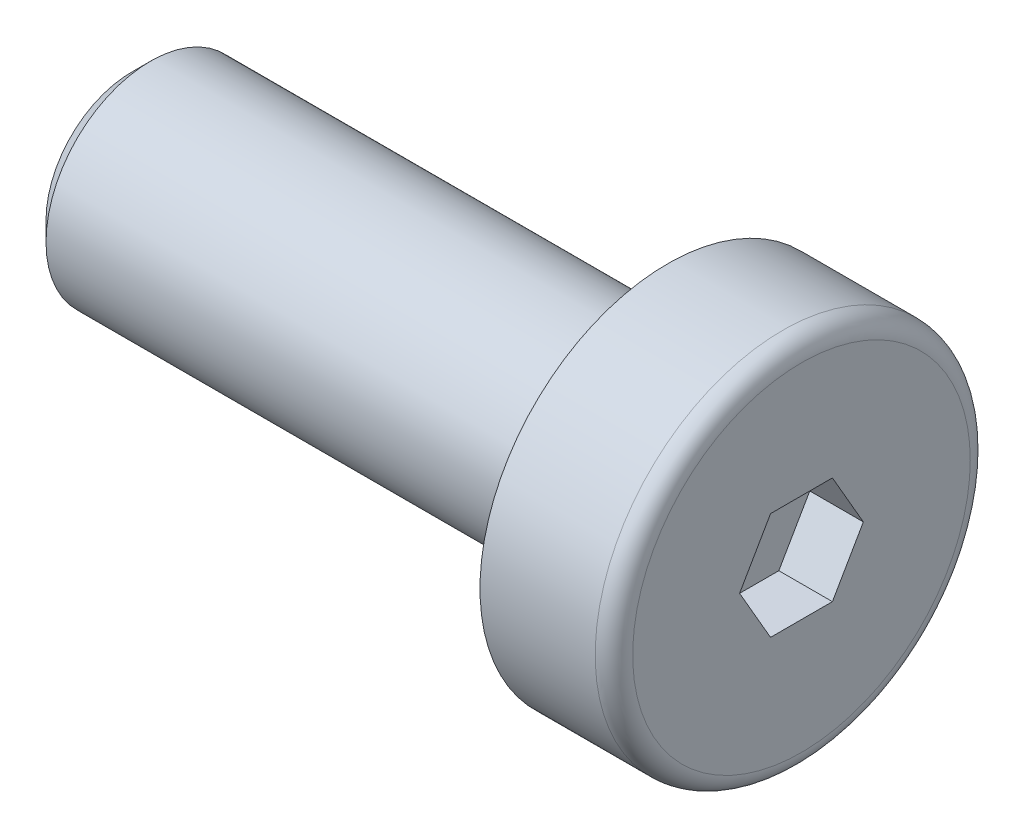
ISO-10303-21;
HEADER;
FILE_DESCRIPTION(('STEP AP214'),'2;1');
FILE_NAME('part.step','',(''),(''),'','','');
FILE_SCHEMA(('AUTOMOTIVE_DESIGN { 1 0 10303 214 1 1 1 1 }'));
ENDSEC;
DATA;
#1=APPLICATION_CONTEXT('core data for automotive mechanical design processes');
#2=APPLICATION_PROTOCOL_DEFINITION('international standard','automotive_design',2000,#1);
#3=PRODUCT_CONTEXT('',#1,'mechanical');
#4=PRODUCT('Part','Part','',(#3));
#5=PRODUCT_RELATED_PRODUCT_CATEGORY('part','',(#4));
#6=PRODUCT_DEFINITION_FORMATION('','',#4);
#7=PRODUCT_DEFINITION_CONTEXT('part definition',#1,'design');
#8=PRODUCT_DEFINITION('design','',#6,#7);
#9=PRODUCT_DEFINITION_SHAPE('','',#8);
#10=(LENGTH_UNIT() NAMED_UNIT(*) SI_UNIT(.MILLI.,.METRE.));
#11=(NAMED_UNIT(*) PLANE_ANGLE_UNIT() SI_UNIT($,.RADIAN.));
#12=(NAMED_UNIT(*) SI_UNIT($,.STERADIAN.) SOLID_ANGLE_UNIT());
#13=UNCERTAINTY_MEASURE_WITH_UNIT(LENGTH_MEASURE(1.E-05),#10,'distance_accuracy_value','');
#14=(GEOMETRIC_REPRESENTATION_CONTEXT(3) GLOBAL_UNCERTAINTY_ASSIGNED_CONTEXT((#13)) GLOBAL_UNIT_ASSIGNED_CONTEXT((#10,
#11,#12)) REPRESENTATION_CONTEXT('',''));
#15=CARTESIAN_POINT('',(0.,0.,0.));
#16=DIRECTION('',(0.,0.,1.));
#17=DIRECTION('',(1.,0.,0.));
#18=AXIS2_PLACEMENT_3D('',#15,#16,#17);
#19=CARTESIAN_POINT('',(0.,0.,0.));
#20=DIRECTION('',(-1.,0.,0.));
#21=DIRECTION('',(0.,0.,-1.));
#22=AXIS2_PLACEMENT_3D('',#19,#20,#21);
#23=PLANE('',#22);
#24=DIRECTION('',(0.,0.866025403784438,-0.5));
#25=VECTOR('',#24,1.);
#26=CARTESIAN_POINT('',(0.,0.,1.15470053837925));
#27=LINE('',#26,#25);
#28=CARTESIAN_POINT('',(0.,0.,1.15470053837925));
#29=VERTEX_POINT('',#28);
#30=CARTESIAN_POINT('',(0.,1.,0.577350269189625));
#31=VERTEX_POINT('',#30);
#32=EDGE_CURVE('E106',#29,#31,#27,.T.);
#33=ORIENTED_EDGE('',*,*,#32,.T.);
#34=DIRECTION('',(0.,0.,-1.));
#35=VECTOR('',#34,1.);
#36=CARTESIAN_POINT('',(0.,1.,0.577350269189625));
#37=LINE('',#36,#35);
#38=CARTESIAN_POINT('',(0.,1.,-0.577350269189626));
#39=VERTEX_POINT('',#38);
#40=EDGE_CURVE('E110',#31,#39,#37,.T.);
#41=ORIENTED_EDGE('',*,*,#40,.T.);
#42=DIRECTION('',(0.,-0.866025403784438,-0.5));
#43=VECTOR('',#42,1.);
#44=CARTESIAN_POINT('',(0.,1.,-0.577350269189626));
#45=LINE('',#44,#43);
#46=CARTESIAN_POINT('',(0.,0.,-1.15470053837925));
#47=VERTEX_POINT('',#46);
#48=EDGE_CURVE('E115',#39,#47,#45,.T.);
#49=ORIENTED_EDGE('',*,*,#48,.T.);
#50=DIRECTION('',(0.,-0.866025403784439,0.5));
#51=VECTOR('',#50,1.);
#52=CARTESIAN_POINT('',(0.,0.,-1.15470053837925));
#53=LINE('',#52,#51);
#54=CARTESIAN_POINT('',(0.,-1.,-0.577350269189626));
#55=VERTEX_POINT('',#54);
#56=EDGE_CURVE('E125',#47,#55,#53,.T.);
#57=ORIENTED_EDGE('',*,*,#56,.T.);
#58=DIRECTION('',(0.,0.,1.));
#59=VECTOR('',#58,1.);
#60=CARTESIAN_POINT('',(0.,-1.,-0.577350269189626));
#61=LINE('',#60,#59);
#62=CARTESIAN_POINT('',(0.,-0.999999999999999,0.577350269189627));
#63=VERTEX_POINT('',#62);
#64=EDGE_CURVE('E128',#55,#63,#61,.T.);
#65=ORIENTED_EDGE('',*,*,#64,.T.);
#66=DIRECTION('',(0.,0.866025403784439,0.5));
#67=VECTOR('',#66,1.);
#68=CARTESIAN_POINT('',(0.,-0.999999999999999,0.577350269189627));
#69=LINE('',#68,#67);
#70=EDGE_CURVE('E119',#63,#29,#69,.T.);
#71=ORIENTED_EDGE('',*,*,#70,.T.);
#72=EDGE_LOOP('',(#33,#41,#49,#57,#65,#71));
#73=FACE_BOUND('',#72,.T.);
#74=CARTESIAN_POINT('',(0.,0.,0.));
#75=DIRECTION('',(1.,0.,0.));
#76=DIRECTION('',(0.,0.,-1.));
#77=AXIS2_PLACEMENT_3D('',#74,#75,#76);
#78=CIRCLE('',#77,3.15);
#79=CARTESIAN_POINT('',(0.,0.,-3.15));
#80=VERTEX_POINT('',#79);
#81=EDGE_CURVE('E12',#80,#80,#78,.F.);
#82=ORIENTED_EDGE('',*,*,#81,.F.);
#83=EDGE_LOOP('',(#82));
#84=FACE_BOUND('',#83,.T.);
#85=ADVANCED_FACE('F39',(#73,#84),#23,.F.);
#86=CARTESIAN_POINT('',(-123.158940217391,0.,0.));
#87=DIRECTION('',(-1.,0.,0.));
#88=DIRECTION('',(0.,0.,-1.));
#89=AXIS2_PLACEMENT_3D('',#86,#87,#88);
#90=CYLINDRICAL_SURFACE('',#89,3.5);
#91=CARTESIAN_POINT('',(-0.350000000000003,0.,0.));
#92=DIRECTION('',(1.,0.,0.));
#93=DIRECTION('',(0.,0.,-1.));
#94=AXIS2_PLACEMENT_3D('',#91,#92,#93);
#95=CIRCLE('',#94,3.5);
#96=CARTESIAN_POINT('',(-0.350000000000003,0.,-3.5));
#97=VERTEX_POINT('',#96);
#98=EDGE_CURVE('E47',#97,#97,#95,.T.);
#99=ORIENTED_EDGE('',*,*,#98,.F.);
#100=EDGE_LOOP('',(#99));
#101=FACE_BOUND('',#100,.T.);
#102=CARTESIAN_POINT('',(-2.5,0.,0.));
#103=DIRECTION('',(1.,0.,0.));
#104=DIRECTION('',(0.,0.,-1.));
#105=AXIS2_PLACEMENT_3D('',#102,#103,#104);
#106=CIRCLE('',#105,3.5);
#107=CARTESIAN_POINT('',(-2.5,0.,-3.5));
#108=VERTEX_POINT('',#107);
#109=EDGE_CURVE('E143',#108,#108,#106,.T.);
#110=ORIENTED_EDGE('',*,*,#109,.T.);
#111=EDGE_LOOP('',(#110));
#112=FACE_BOUND('',#111,.T.);
#113=ADVANCED_FACE('F155',(#101,#112),#90,.T.);
#114=CARTESIAN_POINT('',(-2.5,3.5,0.));
#115=DIRECTION('',(1.,0.,0.));
#116=DIRECTION('',(0.,0.,1.));
#117=AXIS2_PLACEMENT_3D('',#114,#115,#116);
#118=PLANE('',#117);
#119=ORIENTED_EDGE('',*,*,#109,.F.);
#120=EDGE_LOOP('',(#119));
#121=FACE_BOUND('',#120,.T.);
#122=CARTESIAN_POINT('',(-2.5,0.,0.));
#123=DIRECTION('',(-1.,0.,0.));
#124=DIRECTION('',(0.,0.,1.));
#125=AXIS2_PLACEMENT_3D('',#122,#123,#124);
#126=CIRCLE('',#125,1.95);
#127=CARTESIAN_POINT('',(-2.5,0.,1.95));
#128=VERTEX_POINT('',#127);
#129=EDGE_CURVE('E139',#128,#128,#126,.T.);
#130=ORIENTED_EDGE('',*,*,#129,.F.);
#131=EDGE_LOOP('',(#130));
#132=FACE_BOUND('',#131,.T.);
#133=ADVANCED_FACE('F158',(#121,#132),#118,.F.);
#134=CARTESIAN_POINT('',(0.,0.,0.));
#135=DIRECTION('',(1.,0.,0.));
#136=DIRECTION('',(0.,0.,1.));
#137=AXIS2_PLACEMENT_3D('',#134,#135,#136);
#138=CYLINDRICAL_SURFACE('',#137,1.95);
#139=CARTESIAN_POINT('',(-12.15,0.,0.));
#140=DIRECTION('',(-1.,0.,0.));
#141=DIRECTION('',(0.,0.,1.));
#142=AXIS2_PLACEMENT_3D('',#139,#140,#141);
#143=CIRCLE('',#142,1.95);
#144=CARTESIAN_POINT('',(-12.15,0.,1.95));
#145=VERTEX_POINT('',#144);
#146=EDGE_CURVE('E146',#145,#145,#143,.T.);
#147=ORIENTED_EDGE('',*,*,#146,.F.);
#148=EDGE_LOOP('',(#147));
#149=FACE_BOUND('',#148,.T.);
#150=ORIENTED_EDGE('',*,*,#129,.T.);
#151=EDGE_LOOP('',(#150));
#152=FACE_BOUND('',#151,.T.);
#153=ADVANCED_FACE('F164',(#149,#152),#138,.T.);
#154=CARTESIAN_POINT('',(-12.5,2.,0.));
#155=DIRECTION('',(1.,0.,0.));
#156=DIRECTION('',(0.,0.,1.));
#157=AXIS2_PLACEMENT_3D('',#154,#155,#156);
#158=PLANE('',#157);
#159=CARTESIAN_POINT('',(-12.5,0.,0.));
#160=DIRECTION('',(-1.,0.,0.));
#161=DIRECTION('',(0.,0.,1.));
#162=AXIS2_PLACEMENT_3D('',#159,#160,#161);
#163=CIRCLE('',#162,1.59999999999999);
#164=CARTESIAN_POINT('',(-12.5,0.,1.59999999999999));
#165=VERTEX_POINT('',#164);
#166=EDGE_CURVE('E149',#165,#165,#163,.F.);
#167=ORIENTED_EDGE('',*,*,#166,.F.);
#168=EDGE_LOOP('',(#167));
#169=FACE_BOUND('',#168,.T.);
#170=ADVANCED_FACE('F169',(#169),#158,.F.);
#171=CARTESIAN_POINT('',(-12.15,0.,0.));
#172=DIRECTION('',(1.,0.,0.));
#173=DIRECTION('',(0.,0.,1.));
#174=AXIS2_PLACEMENT_3D('',#171,#172,#173);
#175=CONICAL_SURFACE('',#174,1.95,0.785398163397451);
#176=ORIENTED_EDGE('',*,*,#166,.T.);
#177=EDGE_LOOP('',(#176));
#178=FACE_BOUND('',#177,.T.);
#179=ORIENTED_EDGE('',*,*,#146,.T.);
#180=EDGE_LOOP('',(#179));
#181=FACE_BOUND('',#180,.T.);
#182=ADVANCED_FACE('F175',(#178,#181),#175,.T.);
#183=CARTESIAN_POINT('',(-0.350000000000003,0.,0.));
#184=DIRECTION('',(-1.,0.,0.));
#185=DIRECTION('',(0.,0.,-1.));
#186=AXIS2_PLACEMENT_3D('',#183,#184,#185);
#187=TOROIDAL_SURFACE('',#186,3.15,0.35);
#188=ORIENTED_EDGE('',*,*,#81,.T.);
#189=EDGE_LOOP('',(#188));
#190=FACE_BOUND('',#189,.T.);
#191=ORIENTED_EDGE('',*,*,#98,.T.);
#192=EDGE_LOOP('',(#191));
#193=FACE_BOUND('',#192,.T.);
#194=ADVANCED_FACE('F41',(#190,#193),#187,.T.);
#195=CARTESIAN_POINT('',(-5.55505046330389,-0.999999999999999,0.577350269189627));
#196=DIRECTION('',(0.,-0.5,0.866025403784438));
#197=DIRECTION('',(0.,0.866025403784439,0.5));
#198=AXIS2_PLACEMENT_3D('',#195,#196,#197);
#199=PLANE('',#198);
#200=DIRECTION('',(0.,-0.866025403784439,-0.5));
#201=VECTOR('',#200,1.);
#202=CARTESIAN_POINT('',(-1.,-0.999999999999999,0.577350269189627));
#203=LINE('',#202,#201);
#204=CARTESIAN_POINT('',(-1.,0.,1.15470053837925));
#205=VERTEX_POINT('',#204);
#206=CARTESIAN_POINT('',(-1.,-0.999999999999999,0.577350269189627));
#207=VERTEX_POINT('',#206);
#208=EDGE_CURVE('E140',#205,#207,#203,.T.);
#209=ORIENTED_EDGE('',*,*,#208,.F.);
#210=DIRECTION('',(1.,0.,0.));
#211=VECTOR('',#210,1.);
#212=CARTESIAN_POINT('',(-5.55505046330389,0.,1.15470053837925));
#213=LINE('',#212,#211);
#214=EDGE_CURVE('E54',#205,#29,#213,.T.);
#215=ORIENTED_EDGE('',*,*,#214,.T.);
#216=ORIENTED_EDGE('',*,*,#70,.F.);
#217=DIRECTION('',(1.,0.,0.));
#218=VECTOR('',#217,1.);
#219=CARTESIAN_POINT('',(-5.55505046330389,-0.999999999999999,0.577350269189627));
#220=LINE('',#219,#218);
#221=EDGE_CURVE('E130',#207,#63,#220,.T.);
#222=ORIENTED_EDGE('',*,*,#221,.F.);
#223=EDGE_LOOP('',(#209,#215,#216,#222));
#224=FACE_BOUND('',#223,.T.);
#225=ADVANCED_FACE('F189',(#224),#199,.F.);
#226=CARTESIAN_POINT('',(-5.55505046330389,-1.,-0.577350269189626));
#227=DIRECTION('',(0.,-1.,0.));
#228=DIRECTION('',(0.,0.,1.));
#229=AXIS2_PLACEMENT_3D('',#226,#227,#228);
#230=PLANE('',#229);
#231=DIRECTION('',(0.,0.,-1.));
#232=VECTOR('',#231,1.);
#233=CARTESIAN_POINT('',(-1.,-1.,-0.577350269189626));
#234=LINE('',#233,#232);
#235=CARTESIAN_POINT('',(-1.,-0.999999999999999,-0.577350269189626));
#236=VERTEX_POINT('',#235);
#237=EDGE_CURVE('E76',#207,#236,#234,.T.);
#238=ORIENTED_EDGE('',*,*,#237,.F.);
#239=ORIENTED_EDGE('',*,*,#221,.T.);
#240=ORIENTED_EDGE('',*,*,#64,.F.);
#241=DIRECTION('',(1.,0.,0.));
#242=VECTOR('',#241,1.);
#243=CARTESIAN_POINT('',(-5.55505046330389,-1.,-0.577350269189626));
#244=LINE('',#243,#242);
#245=EDGE_CURVE('E132',#236,#55,#244,.T.);
#246=ORIENTED_EDGE('',*,*,#245,.F.);
#247=EDGE_LOOP('',(#238,#239,#240,#246));
#248=FACE_BOUND('',#247,.T.);
#249=ADVANCED_FACE('F196',(#248),#230,.F.);
#250=CARTESIAN_POINT('',(-5.55505046330389,0.,-1.15470053837925));
#251=DIRECTION('',(0.,-0.5,-0.866025403784439));
#252=DIRECTION('',(0.,-0.866025403784439,0.5));
#253=AXIS2_PLACEMENT_3D('',#250,#251,#252);
#254=PLANE('',#253);
#255=DIRECTION('',(0.,0.866025403784439,-0.5));
#256=VECTOR('',#255,1.);
#257=CARTESIAN_POINT('',(-1.,0.,-1.15470053837925));
#258=LINE('',#257,#256);
#259=CARTESIAN_POINT('',(-1.,0.,-1.15470053837925));
#260=VERTEX_POINT('',#259);
#261=EDGE_CURVE('E220',#236,#260,#258,.T.);
#262=ORIENTED_EDGE('',*,*,#261,.F.);
#263=ORIENTED_EDGE('',*,*,#245,.T.);
#264=ORIENTED_EDGE('',*,*,#56,.F.);
#265=DIRECTION('',(1.,0.,0.));
#266=VECTOR('',#265,1.);
#267=CARTESIAN_POINT('',(-5.55505046330389,0.,-1.15470053837925));
#268=LINE('',#267,#266);
#269=EDGE_CURVE('E134',#260,#47,#268,.T.);
#270=ORIENTED_EDGE('',*,*,#269,.F.);
#271=EDGE_LOOP('',(#262,#263,#264,#270));
#272=FACE_BOUND('',#271,.T.);
#273=ADVANCED_FACE('F201',(#272),#254,.F.);
#274=CARTESIAN_POINT('',(-5.55505046330389,1.,-0.577350269189626));
#275=DIRECTION('',(0.,0.5,-0.866025403784438));
#276=DIRECTION('',(0.,-0.866025403784439,-0.5));
#277=AXIS2_PLACEMENT_3D('',#274,#275,#276);
#278=PLANE('',#277);
#279=DIRECTION('',(0.,0.866025403784439,0.5));
#280=VECTOR('',#279,1.);
#281=CARTESIAN_POINT('',(-1.,1.,-0.577350269189626));
#282=LINE('',#281,#280);
#283=CARTESIAN_POINT('',(-1.,1.,-0.577350269189626));
#284=VERTEX_POINT('',#283);
#285=EDGE_CURVE('E224',#260,#284,#282,.T.);
#286=ORIENTED_EDGE('',*,*,#285,.F.);
#287=ORIENTED_EDGE('',*,*,#269,.T.);
#288=ORIENTED_EDGE('',*,*,#48,.F.);
#289=DIRECTION('',(1.,0.,0.));
#290=VECTOR('',#289,1.);
#291=CARTESIAN_POINT('',(-5.55505046330389,1.,-0.577350269189626));
#292=LINE('',#291,#290);
#293=EDGE_CURVE('E107',#284,#39,#292,.T.);
#294=ORIENTED_EDGE('',*,*,#293,.F.);
#295=EDGE_LOOP('',(#286,#287,#288,#294));
#296=FACE_BOUND('',#295,.T.);
#297=ADVANCED_FACE('F209',(#296),#278,.F.);
#298=CARTESIAN_POINT('',(-5.55505046330389,1.,0.577350269189625));
#299=DIRECTION('',(0.,1.,0.));
#300=DIRECTION('',(0.,0.,-1.));
#301=AXIS2_PLACEMENT_3D('',#298,#299,#300);
#302=PLANE('',#301);
#303=DIRECTION('',(0.,0.,1.));
#304=VECTOR('',#303,1.);
#305=CARTESIAN_POINT('',(-1.,1.,0.577350269189625));
#306=LINE('',#305,#304);
#307=CARTESIAN_POINT('',(-1.,1.,0.577350269189625));
#308=VERTEX_POINT('',#307);
#309=EDGE_CURVE('E63',#284,#308,#306,.T.);
#310=ORIENTED_EDGE('',*,*,#309,.F.);
#311=ORIENTED_EDGE('',*,*,#293,.T.);
#312=ORIENTED_EDGE('',*,*,#40,.F.);
#313=DIRECTION('',(1.,0.,0.));
#314=VECTOR('',#313,1.);
#315=CARTESIAN_POINT('',(-5.55505046330389,1.,0.577350269189625));
#316=LINE('',#315,#314);
#317=EDGE_CURVE('E102',#308,#31,#316,.T.);
#318=ORIENTED_EDGE('',*,*,#317,.F.);
#319=EDGE_LOOP('',(#310,#311,#312,#318));
#320=FACE_BOUND('',#319,.T.);
#321=ADVANCED_FACE('F111',(#320),#302,.F.);
#322=CARTESIAN_POINT('',(-5.55505046330389,0.,1.15470053837925));
#323=DIRECTION('',(0.,0.5,0.866025403784438));
#324=DIRECTION('',(0.,0.866025403784439,-0.5));
#325=AXIS2_PLACEMENT_3D('',#322,#323,#324);
#326=PLANE('',#325);
#327=DIRECTION('',(0.,-0.866025403784439,0.5));
#328=VECTOR('',#327,1.);
#329=CARTESIAN_POINT('',(-1.,0.,1.15470053837925));
#330=LINE('',#329,#328);
#331=EDGE_CURVE('E85',#308,#205,#330,.T.);
#332=ORIENTED_EDGE('',*,*,#331,.F.);
#333=ORIENTED_EDGE('',*,*,#317,.T.);
#334=ORIENTED_EDGE('',*,*,#32,.F.);
#335=ORIENTED_EDGE('',*,*,#214,.F.);
#336=EDGE_LOOP('',(#332,#333,#334,#335));
#337=FACE_BOUND('',#336,.T.);
#338=ADVANCED_FACE('F104',(#337),#326,.F.);
#339=CARTESIAN_POINT('',(-1.,3.5,0.));
#340=DIRECTION('',(1.,0.,0.));
#341=DIRECTION('',(0.,0.,1.));
#342=AXIS2_PLACEMENT_3D('',#339,#340,#341);
#343=PLANE('',#342);
#344=ORIENTED_EDGE('',*,*,#208,.T.);
#345=ORIENTED_EDGE('',*,*,#237,.T.);
#346=ORIENTED_EDGE('',*,*,#261,.T.);
#347=ORIENTED_EDGE('',*,*,#285,.T.);
#348=ORIENTED_EDGE('',*,*,#309,.T.);
#349=ORIENTED_EDGE('',*,*,#331,.T.);
#350=EDGE_LOOP('',(#344,#345,#346,#347,#348,#349));
#351=FACE_BOUND('',#350,.T.);
#352=ADVANCED_FACE('F206',(#351),#343,.T.);
#353=CLOSED_SHELL('',(#85,#113,#133,#153,#170,#182,#194,#225,#249,#273,#297,#321,#338,#352));
#354=MANIFOLD_SOLID_BREP('B2',#353);
#355=ADVANCED_BREP_SHAPE_REPRESENTATION('',(#18,#354),#14);
#356=SHAPE_DEFINITION_REPRESENTATION(#9,#355);
ENDSEC;
END-ISO-10303-21;
